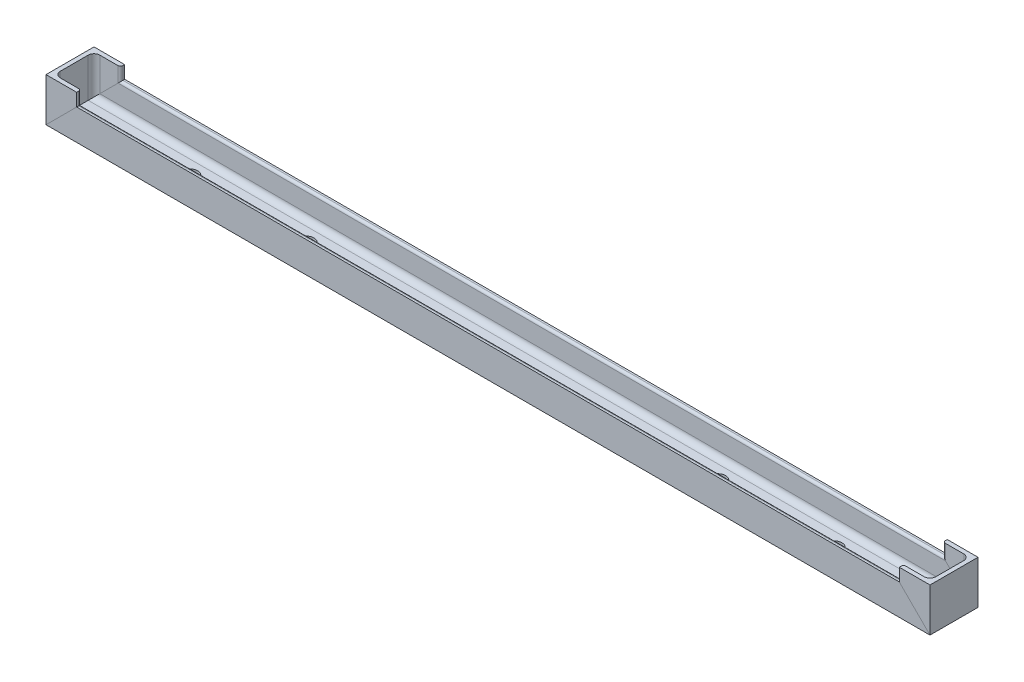
ISO-10303-21;
HEADER;
FILE_DESCRIPTION(('STEP AP214'),'2;1');
FILE_NAME('part.step','',(''),(''),'','','');
FILE_SCHEMA(('AUTOMOTIVE_DESIGN { 1 0 10303 214 1 1 1 1 }'));
ENDSEC;
DATA;
#1=APPLICATION_CONTEXT('core data for automotive mechanical design processes');
#2=APPLICATION_PROTOCOL_DEFINITION('international standard','automotive_design',2000,#1);
#3=PRODUCT_CONTEXT('',#1,'mechanical');
#4=PRODUCT('Part','Part','',(#3));
#5=PRODUCT_RELATED_PRODUCT_CATEGORY('part','',(#4));
#6=PRODUCT_DEFINITION_FORMATION('','',#4);
#7=PRODUCT_DEFINITION_CONTEXT('part definition',#1,'design');
#8=PRODUCT_DEFINITION('design','',#6,#7);
#9=PRODUCT_DEFINITION_SHAPE('','',#8);
#10=(LENGTH_UNIT() NAMED_UNIT(*) SI_UNIT(.MILLI.,.METRE.));
#11=(NAMED_UNIT(*) PLANE_ANGLE_UNIT() SI_UNIT($,.RADIAN.));
#12=(NAMED_UNIT(*) SI_UNIT($,.STERADIAN.) SOLID_ANGLE_UNIT());
#13=UNCERTAINTY_MEASURE_WITH_UNIT(LENGTH_MEASURE(1.E-05),#10,'distance_accuracy_value','');
#14=(GEOMETRIC_REPRESENTATION_CONTEXT(3) GLOBAL_UNCERTAINTY_ASSIGNED_CONTEXT((#13)) GLOBAL_UNIT_ASSIGNED_CONTEXT((#10,
#11,#12)) REPRESENTATION_CONTEXT('',''));
#15=CARTESIAN_POINT('',(0.,0.,0.));
#16=DIRECTION('',(0.,0.,1.));
#17=DIRECTION('',(1.,0.,0.));
#18=AXIS2_PLACEMENT_3D('',#15,#16,#17);
#19=CARTESIAN_POINT('',(-430.9,45.2499987337387,23.1));
#20=DIRECTION('',(0.,1.,0.));
#21=DIRECTION('',(0.,0.,1.));
#22=AXIS2_PLACEMENT_3D('',#19,#20,#21);
#23=PLANE('',#22);
#24=DIRECTION('',(-1.,0.,0.));
#25=VECTOR('',#24,1.);
#26=CARTESIAN_POINT('',(-460.4,45.2499987337387,25.));
#27=LINE('',#26,#25);
#28=CARTESIAN_POINT('',(-428.4,45.2499987337387,25.));
#29=VERTEX_POINT('',#28);
#30=CARTESIAN_POINT('',(-460.4,45.2499987337387,25.));
#31=VERTEX_POINT('',#30);
#32=EDGE_CURVE('E197',#29,#31,#27,.T.);
#33=ORIENTED_EDGE('',*,*,#32,.F.);
#34=DIRECTION('',(0.,0.,1.));
#35=VECTOR('',#34,1.);
#36=CARTESIAN_POINT('',(-428.4,45.2499987337387,25.));
#37=LINE('',#36,#35);
#38=CARTESIAN_POINT('',(-428.4,45.2499987337387,23.1));
#39=VERTEX_POINT('',#38);
#40=EDGE_CURVE('E200',#39,#29,#37,.T.);
#41=ORIENTED_EDGE('',*,*,#40,.F.);
#42=CARTESIAN_POINT('',(-430.9,45.2499987337387,23.1));
#43=DIRECTION('',(0.,-1.,0.));
#44=DIRECTION('',(0.,0.,1.));
#45=AXIS2_PLACEMENT_3D('',#42,#43,#44);
#46=CIRCLE('',#45,2.5);
#47=CARTESIAN_POINT('',(-430.9,45.2499987337387,20.6));
#48=VERTEX_POINT('',#47);
#49=EDGE_CURVE('E202',#48,#39,#46,.T.);
#50=ORIENTED_EDGE('',*,*,#49,.F.);
#51=DIRECTION('',(1.,0.,0.));
#52=VECTOR('',#51,1.);
#53=CARTESIAN_POINT('',(-430.9,45.2499987337387,20.6));
#54=LINE('',#53,#52);
#55=CARTESIAN_POINT('',(-450.,45.2499987337387,20.6));
#56=VERTEX_POINT('',#55);
#57=EDGE_CURVE('E204',#56,#48,#54,.T.);
#58=ORIENTED_EDGE('',*,*,#57,.F.);
#59=CARTESIAN_POINT('',(-450.,45.2499987337387,14.6));
#60=DIRECTION('',(0.,1.,0.));
#61=DIRECTION('',(0.,0.,-1.));
#62=AXIS2_PLACEMENT_3D('',#59,#60,#61);
#63=CIRCLE('',#62,6.);
#64=CARTESIAN_POINT('',(-456.,45.2499987337387,14.6));
#65=VERTEX_POINT('',#64);
#66=EDGE_CURVE('E206',#65,#56,#63,.T.);
#67=ORIENTED_EDGE('',*,*,#66,.F.);
#68=DIRECTION('',(0.,0.,1.));
#69=VECTOR('',#68,1.);
#70=CARTESIAN_POINT('',(-456.,45.2499987337387,14.6));
#71=LINE('',#70,#69);
#72=CARTESIAN_POINT('',(-456.,45.2499987337387,-14.6));
#73=VERTEX_POINT('',#72);
#74=EDGE_CURVE('E208',#73,#65,#71,.T.);
#75=ORIENTED_EDGE('',*,*,#74,.F.);
#76=CARTESIAN_POINT('',(-450.,45.2499987337387,-14.6));
#77=DIRECTION('',(0.,1.,0.));
#78=DIRECTION('',(0.,0.,1.));
#79=AXIS2_PLACEMENT_3D('',#76,#77,#78);
#80=CIRCLE('',#79,6.);
#81=CARTESIAN_POINT('',(-450.,45.2499987337387,-20.6));
#82=VERTEX_POINT('',#81);
#83=EDGE_CURVE('E210',#82,#73,#80,.T.);
#84=ORIENTED_EDGE('',*,*,#83,.F.);
#85=DIRECTION('',(-1.,0.,0.));
#86=VECTOR('',#85,1.);
#87=CARTESIAN_POINT('',(-430.9,45.2499987337387,-20.6));
#88=LINE('',#87,#86);
#89=CARTESIAN_POINT('',(-430.9,45.2499987337387,-20.6));
#90=VERTEX_POINT('',#89);
#91=EDGE_CURVE('E212',#90,#82,#88,.T.);
#92=ORIENTED_EDGE('',*,*,#91,.F.);
#93=CARTESIAN_POINT('',(-430.9,45.2499987337387,-23.1));
#94=DIRECTION('',(0.,-1.,0.));
#95=DIRECTION('',(0.,0.,-1.));
#96=AXIS2_PLACEMENT_3D('',#93,#94,#95);
#97=CIRCLE('',#96,2.5);
#98=CARTESIAN_POINT('',(-428.4,45.2499987337387,-23.1));
#99=VERTEX_POINT('',#98);
#100=EDGE_CURVE('E214',#99,#90,#97,.T.);
#101=ORIENTED_EDGE('',*,*,#100,.F.);
#102=DIRECTION('',(0.,0.,1.));
#103=VECTOR('',#102,1.);
#104=CARTESIAN_POINT('',(-428.4,45.2499987337387,-25.));
#105=LINE('',#104,#103);
#106=CARTESIAN_POINT('',(-428.4,45.2499987337387,-25.));
#107=VERTEX_POINT('',#106);
#108=EDGE_CURVE('E170',#107,#99,#105,.T.);
#109=ORIENTED_EDGE('',*,*,#108,.F.);
#110=DIRECTION('',(1.,0.,0.));
#111=VECTOR('',#110,1.);
#112=CARTESIAN_POINT('',(-460.4,45.2499987337387,-25.));
#113=LINE('',#112,#111);
#114=CARTESIAN_POINT('',(-460.4,45.2499987337387,-25.));
#115=VERTEX_POINT('',#114);
#116=EDGE_CURVE('E104',#115,#107,#113,.T.);
#117=ORIENTED_EDGE('',*,*,#116,.F.);
#118=DIRECTION('',(0.,0.,-1.));
#119=VECTOR('',#118,1.);
#120=CARTESIAN_POINT('',(-460.4,45.2499987337387,-25.));
#121=LINE('',#120,#119);
#122=EDGE_CURVE('E111',#31,#115,#121,.T.);
#123=ORIENTED_EDGE('',*,*,#122,.F.);
#124=EDGE_LOOP('',(#33,#41,#50,#58,#67,#75,#84,#92,#101,#109,#117,#123));
#125=FACE_BOUND('',#124,.T.);
#126=ADVANCED_FACE('F43',(#125),#23,.T.);
#127=CARTESIAN_POINT('',(-460.4,-0.199998781726211,-25.));
#128=DIRECTION('',(0.,0.,1.));
#129=DIRECTION('',(1.,0.,0.));
#130=AXIS2_PLACEMENT_3D('',#127,#128,#129);
#131=PLANE('',#130);
#132=DIRECTION('',(-0.707106781186547,-0.707106781186548,0.));
#133=VECTOR('',#132,1.);
#134=CARTESIAN_POINT('',(-230.200000609137,230.199999390863,-25.0000000000002));
#135=LINE('',#134,#133);
#136=CARTESIAN_POINT('',(-428.4,31.9999999999998,-25.));
#137=VERTEX_POINT('',#136);
#138=CARTESIAN_POINT('',(-460.400000609137,-1.23818000929594E-13,-25.));
#139=VERTEX_POINT('',#138);
#140=EDGE_CURVE('E163',#137,#139,#135,.T.);
#141=ORIENTED_EDGE('',*,*,#140,.T.);
#142=DIRECTION('',(0.,1.,0.));
#143=VECTOR('',#142,1.);
#144=CARTESIAN_POINT('',(-460.4,-0.199998781726211,-25.));
#145=LINE('',#144,#143);
#146=EDGE_CURVE('E243',#139,#115,#145,.T.);
#147=ORIENTED_EDGE('',*,*,#146,.T.);
#148=ORIENTED_EDGE('',*,*,#116,.T.);
#149=DIRECTION('',(0.,1.,0.));
#150=VECTOR('',#149,1.);
#151=CARTESIAN_POINT('',(-428.4,-0.199998781726211,-25.));
#152=LINE('',#151,#150);
#153=EDGE_CURVE('E173',#137,#107,#152,.T.);
#154=ORIENTED_EDGE('',*,*,#153,.F.);
#155=EDGE_LOOP('',(#141,#147,#148,#154));
#156=FACE_BOUND('',#155,.T.);
#157=ADVANCED_FACE('F512',(#156),#131,.F.);
#158=CARTESIAN_POINT('',(-428.4,-0.199998781726211,-25.));
#159=DIRECTION('',(-1.,0.,0.));
#160=DIRECTION('',(0.,0.,1.));
#161=AXIS2_PLACEMENT_3D('',#158,#159,#160);
#162=PLANE('',#161);
#163=DIRECTION('',(0.,0.,-1.));
#164=VECTOR('',#163,1.);
#165=CARTESIAN_POINT('',(-428.4,31.9999999999999,-25.));
#166=LINE('',#165,#164);
#167=CARTESIAN_POINT('',(-428.4,31.9999999999999,-23.1));
#168=VERTEX_POINT('',#167);
#169=EDGE_CURVE('E152',#168,#137,#166,.T.);
#170=ORIENTED_EDGE('',*,*,#169,.T.);
#171=ORIENTED_EDGE('',*,*,#153,.T.);
#172=ORIENTED_EDGE('',*,*,#108,.T.);
#173=DIRECTION('',(0.,1.,0.));
#174=VECTOR('',#173,1.);
#175=CARTESIAN_POINT('',(-428.4,-0.199998781726211,-23.1));
#176=LINE('',#175,#174);
#177=EDGE_CURVE('E167',#168,#99,#176,.T.);
#178=ORIENTED_EDGE('',*,*,#177,.F.);
#179=EDGE_LOOP('',(#170,#171,#172,#178));
#180=FACE_BOUND('',#179,.T.);
#181=ADVANCED_FACE('F169',(#180),#162,.F.);
#182=CARTESIAN_POINT('',(-430.9,-0.199998781726211,-23.1));
#183=DIRECTION('',(0.,1.,0.));
#184=DIRECTION('',(0.,0.,1.));
#185=AXIS2_PLACEMENT_3D('',#182,#183,#184);
#186=CYLINDRICAL_SURFACE('',#185,2.5);
#187=CARTESIAN_POINT('',(-430.9,29.4999999999999,-23.1));
#188=DIRECTION('',(-0.707106781186548,0.707106781186547,0.));
#189=DIRECTION('',(-0.707106781186547,-0.707106781186548,0.));
#190=AXIS2_PLACEMENT_3D('',#187,#188,#189);
#191=ELLIPSE('',#190,3.53553390593274,2.5);
#192=CARTESIAN_POINT('',(-430.9,29.4999999999999,-20.6));
#193=VERTEX_POINT('',#192);
#194=EDGE_CURVE('E164',#193,#168,#191,.T.);
#195=ORIENTED_EDGE('',*,*,#194,.T.);
#196=ORIENTED_EDGE('',*,*,#177,.T.);
#197=ORIENTED_EDGE('',*,*,#100,.T.);
#198=DIRECTION('',(0.,1.,0.));
#199=VECTOR('',#198,1.);
#200=CARTESIAN_POINT('',(-430.9,-0.199998781726211,-20.6));
#201=LINE('',#200,#199);
#202=EDGE_CURVE('E174',#193,#90,#201,.T.);
#203=ORIENTED_EDGE('',*,*,#202,.F.);
#204=EDGE_LOOP('',(#195,#196,#197,#203));
#205=FACE_BOUND('',#204,.T.);
#206=ADVANCED_FACE('F177',(#205),#186,.T.);
#207=CARTESIAN_POINT('',(-430.9,-0.199998781726211,-20.6));
#208=DIRECTION('',(0.,0.,-1.));
#209=DIRECTION('',(-1.,0.,0.));
#210=AXIS2_PLACEMENT_3D('',#207,#208,#209);
#211=PLANE('',#210);
#212=DIRECTION('',(0.707106781186547,0.707106781186548,0.));
#213=VECTOR('',#212,1.);
#214=CARTESIAN_POINT('',(-215.450000609137,244.949999390863,-20.6000000000003));
#215=LINE('',#214,#213);
#216=CARTESIAN_POINT('',(-450.,10.3999999999999,-20.6));
#217=VERTEX_POINT('',#216);
#218=EDGE_CURVE('E182',#217,#193,#215,.T.);
#219=ORIENTED_EDGE('',*,*,#218,.T.);
#220=ORIENTED_EDGE('',*,*,#202,.T.);
#221=ORIENTED_EDGE('',*,*,#91,.T.);
#222=DIRECTION('',(0.,1.,0.));
#223=VECTOR('',#222,1.);
#224=CARTESIAN_POINT('',(-450.,-0.199998781726211,-20.6));
#225=LINE('',#224,#223);
#226=EDGE_CURVE('E238',#217,#82,#225,.T.);
#227=ORIENTED_EDGE('',*,*,#226,.F.);
#228=EDGE_LOOP('',(#219,#220,#221,#227));
#229=FACE_BOUND('',#228,.T.);
#230=ADVANCED_FACE('F829',(#229),#211,.F.);
#231=CARTESIAN_POINT('',(-450.,-0.199998781726211,-14.6));
#232=DIRECTION('',(0.,1.,0.));
#233=DIRECTION('',(0.,0.,1.));
#234=AXIS2_PLACEMENT_3D('',#231,#232,#233);
#235=CYLINDRICAL_SURFACE('',#234,6.);
#236=CARTESIAN_POINT('',(-450.,10.3999999999999,-14.6));
#237=DIRECTION('',(-0.707106781186548,0.707106781186547,0.));
#238=DIRECTION('',(-0.707106781186547,-0.707106781186548,0.));
#239=AXIS2_PLACEMENT_3D('',#236,#237,#238);
#240=ELLIPSE('',#239,8.48528137423857,6.);
#241=CARTESIAN_POINT('',(-456.,4.3999999999999,-14.6));
#242=VERTEX_POINT('',#241);
#243=EDGE_CURVE('E393',#242,#217,#240,.F.);
#244=ORIENTED_EDGE('',*,*,#243,.T.);
#245=ORIENTED_EDGE('',*,*,#226,.T.);
#246=ORIENTED_EDGE('',*,*,#83,.T.);
#247=DIRECTION('',(0.,1.,0.));
#248=VECTOR('',#247,1.);
#249=CARTESIAN_POINT('',(-456.,-0.199998781726211,-14.6));
#250=LINE('',#249,#248);
#251=EDGE_CURVE('E235',#242,#73,#250,.T.);
#252=ORIENTED_EDGE('',*,*,#251,.F.);
#253=EDGE_LOOP('',(#244,#245,#246,#252));
#254=FACE_BOUND('',#253,.T.);
#255=ADVANCED_FACE('F837',(#254),#235,.F.);
#256=CARTESIAN_POINT('',(-456.,-0.199998781726211,14.6));
#257=DIRECTION('',(-1.,0.,0.));
#258=DIRECTION('',(0.,0.,1.));
#259=AXIS2_PLACEMENT_3D('',#256,#257,#258);
#260=PLANE('',#259);
#261=DIRECTION('',(0.,0.,-1.));
#262=VECTOR('',#261,1.);
#263=CARTESIAN_POINT('',(-456.,4.3999999999999,14.6));
#264=LINE('',#263,#262);
#265=CARTESIAN_POINT('',(-456.,4.3999999999999,14.6));
#266=VERTEX_POINT('',#265);
#267=EDGE_CURVE('E390',#266,#242,#264,.T.);
#268=ORIENTED_EDGE('',*,*,#267,.T.);
#269=ORIENTED_EDGE('',*,*,#251,.T.);
#270=ORIENTED_EDGE('',*,*,#74,.T.);
#271=DIRECTION('',(0.,1.,0.));
#272=VECTOR('',#271,1.);
#273=CARTESIAN_POINT('',(-456.,-0.199998781726211,14.6));
#274=LINE('',#273,#272);
#275=EDGE_CURVE('E232',#266,#65,#274,.T.);
#276=ORIENTED_EDGE('',*,*,#275,.F.);
#277=EDGE_LOOP('',(#268,#269,#270,#276));
#278=FACE_BOUND('',#277,.T.);
#279=ADVANCED_FACE('F846',(#278),#260,.F.);
#280=CARTESIAN_POINT('',(-450.,-0.199998781726211,14.6));
#281=DIRECTION('',(0.,1.,0.));
#282=DIRECTION('',(0.,0.,1.));
#283=AXIS2_PLACEMENT_3D('',#280,#281,#282);
#284=CYLINDRICAL_SURFACE('',#283,6.);
#285=CARTESIAN_POINT('',(-450.,10.3999999999999,14.6));
#286=DIRECTION('',(-0.707106781186548,0.707106781186547,0.));
#287=DIRECTION('',(-0.707106781186547,-0.707106781186548,0.));
#288=AXIS2_PLACEMENT_3D('',#285,#286,#287);
#289=ELLIPSE('',#288,8.48528137423857,6.);
#290=CARTESIAN_POINT('',(-450.,10.4,20.6));
#291=VERTEX_POINT('',#290);
#292=EDGE_CURVE('E387',#291,#266,#289,.F.);
#293=ORIENTED_EDGE('',*,*,#292,.T.);
#294=ORIENTED_EDGE('',*,*,#275,.T.);
#295=ORIENTED_EDGE('',*,*,#66,.T.);
#296=DIRECTION('',(0.,1.,0.));
#297=VECTOR('',#296,1.);
#298=CARTESIAN_POINT('',(-450.,-0.199998781726211,20.6));
#299=LINE('',#298,#297);
#300=EDGE_CURVE('E229',#291,#56,#299,.T.);
#301=ORIENTED_EDGE('',*,*,#300,.F.);
#302=EDGE_LOOP('',(#293,#294,#295,#301));
#303=FACE_BOUND('',#302,.T.);
#304=ADVANCED_FACE('F855',(#303),#284,.F.);
#305=CARTESIAN_POINT('',(-430.9,-0.199998781726211,20.6));
#306=DIRECTION('',(0.,0.,1.));
#307=DIRECTION('',(1.,0.,0.));
#308=AXIS2_PLACEMENT_3D('',#305,#306,#307);
#309=PLANE('',#308);
#310=DIRECTION('',(-0.707106781186547,-0.707106781186548,0.));
#311=VECTOR('',#310,1.);
#312=CARTESIAN_POINT('',(-215.450000609137,244.949999390863,20.5999999999998));
#313=LINE('',#312,#311);
#314=CARTESIAN_POINT('',(-430.9,29.4999999999999,20.6));
#315=VERTEX_POINT('',#314);
#316=EDGE_CURVE('E384',#315,#291,#313,.T.);
#317=ORIENTED_EDGE('',*,*,#316,.T.);
#318=ORIENTED_EDGE('',*,*,#300,.T.);
#319=ORIENTED_EDGE('',*,*,#57,.T.);
#320=DIRECTION('',(0.,1.,0.));
#321=VECTOR('',#320,1.);
#322=CARTESIAN_POINT('',(-430.9,-0.199998781726211,20.6));
#323=LINE('',#322,#321);
#324=EDGE_CURVE('E226',#315,#48,#323,.T.);
#325=ORIENTED_EDGE('',*,*,#324,.F.);
#326=EDGE_LOOP('',(#317,#318,#319,#325));
#327=FACE_BOUND('',#326,.T.);
#328=ADVANCED_FACE('F864',(#327),#309,.F.);
#329=CARTESIAN_POINT('',(-430.9,-0.199998781726211,23.1));
#330=DIRECTION('',(0.,1.,0.));
#331=DIRECTION('',(0.,0.,1.));
#332=AXIS2_PLACEMENT_3D('',#329,#330,#331);
#333=CYLINDRICAL_SURFACE('',#332,2.5);
#334=CARTESIAN_POINT('',(-430.9,29.4999999999999,23.1));
#335=DIRECTION('',(-0.707106781186548,0.707106781186547,0.));
#336=DIRECTION('',(-0.707106781186547,-0.707106781186548,0.));
#337=AXIS2_PLACEMENT_3D('',#334,#335,#336);
#338=ELLIPSE('',#337,3.53553390593274,2.5);
#339=CARTESIAN_POINT('',(-428.4,31.9999999999999,23.1));
#340=VERTEX_POINT('',#339);
#341=EDGE_CURVE('E381',#340,#315,#338,.T.);
#342=ORIENTED_EDGE('',*,*,#341,.T.);
#343=ORIENTED_EDGE('',*,*,#324,.T.);
#344=ORIENTED_EDGE('',*,*,#49,.T.);
#345=DIRECTION('',(0.,1.,0.));
#346=VECTOR('',#345,1.);
#347=CARTESIAN_POINT('',(-428.4,-0.199998781726211,23.1));
#348=LINE('',#347,#346);
#349=EDGE_CURVE('E223',#340,#39,#348,.T.);
#350=ORIENTED_EDGE('',*,*,#349,.F.);
#351=EDGE_LOOP('',(#342,#343,#344,#350));
#352=FACE_BOUND('',#351,.T.);
#353=ADVANCED_FACE('F873',(#352),#333,.T.);
#354=CARTESIAN_POINT('',(-428.4,-0.199998781726211,25.));
#355=DIRECTION('',(-1.,0.,0.));
#356=DIRECTION('',(0.,0.,1.));
#357=AXIS2_PLACEMENT_3D('',#354,#355,#356);
#358=PLANE('',#357);
#359=DIRECTION('',(0.,0.,-1.));
#360=VECTOR('',#359,1.);
#361=CARTESIAN_POINT('',(-428.4,31.9999999999999,25.));
#362=LINE('',#361,#360);
#363=CARTESIAN_POINT('',(-428.4,31.9999999999999,25.));
#364=VERTEX_POINT('',#363);
#365=EDGE_CURVE('E378',#364,#340,#362,.T.);
#366=ORIENTED_EDGE('',*,*,#365,.T.);
#367=ORIENTED_EDGE('',*,*,#349,.T.);
#368=ORIENTED_EDGE('',*,*,#40,.T.);
#369=DIRECTION('',(0.,1.,0.));
#370=VECTOR('',#369,1.);
#371=CARTESIAN_POINT('',(-428.4,-0.199998781726211,25.));
#372=LINE('',#371,#370);
#373=EDGE_CURVE('E220',#364,#29,#372,.T.);
#374=ORIENTED_EDGE('',*,*,#373,.F.);
#375=EDGE_LOOP('',(#366,#367,#368,#374));
#376=FACE_BOUND('',#375,.T.);
#377=ADVANCED_FACE('F882',(#376),#358,.F.);
#378=CARTESIAN_POINT('',(-460.4,-0.199998781726211,25.));
#379=DIRECTION('',(0.,0.,-1.));
#380=DIRECTION('',(-1.,0.,0.));
#381=AXIS2_PLACEMENT_3D('',#378,#379,#380);
#382=PLANE('',#381);
#383=DIRECTION('',(0.707106781186547,0.707106781186548,0.));
#384=VECTOR('',#383,1.);
#385=CARTESIAN_POINT('',(-230.200000609137,230.199999390863,24.9999999999998));
#386=LINE('',#385,#384);
#387=CARTESIAN_POINT('',(-460.400000609137,0.,25.));
#388=VERTEX_POINT('',#387);
#389=EDGE_CURVE('E119',#388,#364,#386,.T.);
#390=ORIENTED_EDGE('',*,*,#389,.T.);
#391=ORIENTED_EDGE('',*,*,#373,.T.);
#392=ORIENTED_EDGE('',*,*,#32,.T.);
#393=DIRECTION('',(0.,1.,0.));
#394=VECTOR('',#393,1.);
#395=CARTESIAN_POINT('',(-460.4,-0.199998781726211,25.));
#396=LINE('',#395,#394);
#397=EDGE_CURVE('E218',#388,#31,#396,.T.);
#398=ORIENTED_EDGE('',*,*,#397,.F.);
#399=EDGE_LOOP('',(#390,#391,#392,#398));
#400=FACE_BOUND('',#399,.T.);
#401=ADVANCED_FACE('F891',(#400),#382,.F.);
#402=CARTESIAN_POINT('',(-460.4,-0.199998781726211,-25.));
#403=DIRECTION('',(1.,0.,0.));
#404=DIRECTION('',(0.,0.,-1.));
#405=AXIS2_PLACEMENT_3D('',#402,#403,#404);
#406=PLANE('',#405);
#407=DIRECTION('',(0.,0.,-1.));
#408=VECTOR('',#407,1.);
#409=CARTESIAN_POINT('',(-460.400001218274,-1.11022302462516E-13,-25.));
#410=LINE('',#409,#408);
#411=EDGE_CURVE('E61',#388,#139,#410,.T.);
#412=ORIENTED_EDGE('',*,*,#411,.F.);
#413=ORIENTED_EDGE('',*,*,#397,.T.);
#414=ORIENTED_EDGE('',*,*,#122,.T.);
#415=ORIENTED_EDGE('',*,*,#146,.F.);
#416=EDGE_LOOP('',(#412,#413,#414,#415));
#417=FACE_BOUND('',#416,.T.);
#418=ADVANCED_FACE('F561',(#417),#406,.F.);
#419=CARTESIAN_POINT('',(-1.21827387067341E-06,0.,-25.));
#420=DIRECTION('',(0.,1.,0.));
#421=DIRECTION('',(0.,0.,1.));
#422=AXIS2_PLACEMENT_3D('',#419,#420,#421);
#423=PLANE('',#422);
#424=CARTESIAN_POINT('',(-335.600004523273,0.,-0.0208885483481435));
#425=DIRECTION('',(0.,1.,0.));
#426=DIRECTION('',(0.,0.,1.));
#427=AXIS2_PLACEMENT_3D('',#424,#425,#426);
#428=CIRCLE('',#427,8.08);
#429=CARTESIAN_POINT('',(-335.600004523273,0.,8.05911145165186));
#430=VERTEX_POINT('',#429);
#431=EDGE_CURVE('E198',#430,#430,#428,.F.);
#432=ORIENTED_EDGE('',*,*,#431,.F.);
#433=EDGE_LOOP('',(#432));
#434=FACE_BOUND('',#433,.T.);
#435=CARTESIAN_POINT('',(-214.400004523273,0.,-0.0208885483481435));
#436=DIRECTION('',(0.,1.,0.));
#437=DIRECTION('',(0.,0.,1.));
#438=AXIS2_PLACEMENT_3D('',#435,#436,#437);
#439=CIRCLE('',#438,8.08);
#440=CARTESIAN_POINT('',(-214.400004523273,0.,8.05911145165186));
#441=VERTEX_POINT('',#440);
#442=EDGE_CURVE('E246',#441,#441,#439,.F.);
#443=ORIENTED_EDGE('',*,*,#442,.F.);
#444=EDGE_LOOP('',(#443));
#445=FACE_BOUND('',#444,.T.);
#446=ORIENTED_EDGE('',*,*,#411,.T.);
#447=DIRECTION('',(-1.,0.,0.));
#448=VECTOR('',#447,1.);
#449=CARTESIAN_POINT('',(-1.21827387067341E-06,0.,-25.));
#450=LINE('',#449,#448);
#451=CARTESIAN_POINT('',(460.400000609137,0.,-25.));
#452=VERTEX_POINT('',#451);
#453=EDGE_CURVE('E13',#452,#139,#450,.T.);
#454=ORIENTED_EDGE('',*,*,#453,.F.);
#455=DIRECTION('',(0.,0.,-1.));
#456=VECTOR('',#455,1.);
#457=CARTESIAN_POINT('',(460.400001218274,0.,-25.));
#458=LINE('',#457,#456);
#459=CARTESIAN_POINT('',(460.400000609137,0.,25.));
#460=VERTEX_POINT('',#459);
#461=EDGE_CURVE('E247',#460,#452,#458,.T.);
#462=ORIENTED_EDGE('',*,*,#461,.F.);
#463=DIRECTION('',(-1.,0.,0.));
#464=VECTOR('',#463,1.);
#465=CARTESIAN_POINT('',(-1.21827387067341E-06,0.,25.));
#466=LINE('',#465,#464);
#467=EDGE_CURVE('E374',#460,#388,#466,.T.);
#468=ORIENTED_EDGE('',*,*,#467,.T.);
#469=EDGE_LOOP('',(#446,#454,#462,#468));
#470=FACE_BOUND('',#469,.T.);
#471=CARTESIAN_POINT('',(335.600004523273,0.,-0.0208885483481435));
#472=DIRECTION('',(0.,-1.,0.));
#473=DIRECTION('',(0.,0.,1.));
#474=AXIS2_PLACEMENT_3D('',#471,#472,#473);
#475=CIRCLE('',#474,8.08);
#476=CARTESIAN_POINT('',(335.600004523273,0.,8.05911145165186));
#477=VERTEX_POINT('',#476);
#478=EDGE_CURVE('E265',#477,#477,#475,.F.);
#479=ORIENTED_EDGE('',*,*,#478,.T.);
#480=EDGE_LOOP('',(#479));
#481=FACE_BOUND('',#480,.T.);
#482=CARTESIAN_POINT('',(214.400004523273,0.,-0.0208885483481435));
#483=DIRECTION('',(0.,-1.,0.));
#484=DIRECTION('',(0.,0.,1.));
#485=AXIS2_PLACEMENT_3D('',#482,#483,#484);
#486=CIRCLE('',#485,8.08);
#487=CARTESIAN_POINT('',(214.400004523273,0.,8.05911145165186));
#488=VERTEX_POINT('',#487);
#489=EDGE_CURVE('E367',#488,#488,#486,.F.);
#490=ORIENTED_EDGE('',*,*,#489,.T.);
#491=EDGE_LOOP('',(#490));
#492=FACE_BOUND('',#491,.T.);
#493=ADVANCED_FACE('F558',(#434,#445,#470,#481,#492),#423,.F.);
#494=CARTESIAN_POINT('',(-1.21827387067341E-06,0.,-25.));
#495=DIRECTION('',(0.,0.,1.));
#496=DIRECTION('',(0.,-1.,0.));
#497=AXIS2_PLACEMENT_3D('',#494,#495,#496);
#498=PLANE('',#497);
#499=DIRECTION('',(-1.,0.,0.));
#500=VECTOR('',#499,1.);
#501=CARTESIAN_POINT('',(-1.21827387761231E-06,31.9999999999999,-25.));
#502=LINE('',#501,#500);
#503=CARTESIAN_POINT('',(428.4,32.,-25.));
#504=VERTEX_POINT('',#503);
#505=EDGE_CURVE('E52',#504,#137,#502,.T.);
#506=ORIENTED_EDGE('',*,*,#505,.F.);
#507=DIRECTION('',(0.707106781186548,-0.707106781186547,0.));
#508=VECTOR('',#507,1.);
#509=CARTESIAN_POINT('',(230.200000609137,230.199999390863,-25.0000000000002));
#510=LINE('',#509,#508);
#511=EDGE_CURVE('E253',#504,#452,#510,.T.);
#512=ORIENTED_EDGE('',*,*,#511,.T.);
#513=ORIENTED_EDGE('',*,*,#453,.T.);
#514=ORIENTED_EDGE('',*,*,#140,.F.);
#515=EDGE_LOOP('',(#506,#512,#513,#514));
#516=FACE_BOUND('',#515,.T.);
#517=ADVANCED_FACE('F511',(#516),#498,.F.);
#518=CARTESIAN_POINT('',(-1.21827387761231E-06,31.9999999999999,-25.));
#519=DIRECTION('',(0.,-1.,0.));
#520=DIRECTION('',(1.,0.,0.));
#521=AXIS2_PLACEMENT_3D('',#518,#519,#520);
#522=PLANE('',#521);
#523=DIRECTION('',(-1.,0.,0.));
#524=VECTOR('',#523,1.);
#525=CARTESIAN_POINT('',(-1.21827387761231E-06,31.9999999999999,-23.1));
#526=LINE('',#525,#524);
#527=CARTESIAN_POINT('',(428.4,32.,-23.1));
#528=VERTEX_POINT('',#527);
#529=EDGE_CURVE('E158',#528,#168,#526,.T.);
#530=ORIENTED_EDGE('',*,*,#529,.F.);
#531=DIRECTION('',(0.,0.,-1.));
#532=VECTOR('',#531,1.);
#533=CARTESIAN_POINT('',(428.4,32.,-25.));
#534=LINE('',#533,#532);
#535=EDGE_CURVE('E261',#528,#504,#534,.T.);
#536=ORIENTED_EDGE('',*,*,#535,.T.);
#537=ORIENTED_EDGE('',*,*,#505,.T.);
#538=ORIENTED_EDGE('',*,*,#169,.F.);
#539=EDGE_LOOP('',(#530,#536,#537,#538));
#540=FACE_BOUND('',#539,.T.);
#541=ADVANCED_FACE('F154',(#540),#522,.F.);
#542=CARTESIAN_POINT('',(-1.21827387761231E-06,29.4999999999999,-23.1));
#543=DIRECTION('',(-1.,0.,0.));
#544=DIRECTION('',(0.,-1.,0.));
#545=AXIS2_PLACEMENT_3D('',#542,#543,#544);
#546=CYLINDRICAL_SURFACE('',#545,2.5);
#547=DIRECTION('',(-1.,0.,0.));
#548=VECTOR('',#547,1.);
#549=CARTESIAN_POINT('',(-1.21827387761231E-06,29.4999999999999,-20.6));
#550=LINE('',#549,#548);
#551=CARTESIAN_POINT('',(430.9,29.5,-20.6));
#552=VERTEX_POINT('',#551);
#553=EDGE_CURVE('E188',#552,#193,#550,.T.);
#554=ORIENTED_EDGE('',*,*,#553,.F.);
#555=CARTESIAN_POINT('',(430.9,29.5,-23.1));
#556=DIRECTION('',(-0.707106781186547,-0.707106781186548,0.));
#557=DIRECTION('',(0.707106781186548,-0.707106781186547,0.));
#558=AXIS2_PLACEMENT_3D('',#555,#556,#557);
#559=ELLIPSE('',#558,3.53553390593274,2.5);
#560=EDGE_CURVE('E186',#552,#528,#559,.T.);
#561=ORIENTED_EDGE('',*,*,#560,.T.);
#562=ORIENTED_EDGE('',*,*,#529,.T.);
#563=ORIENTED_EDGE('',*,*,#194,.F.);
#564=EDGE_LOOP('',(#554,#561,#562,#563));
#565=FACE_BOUND('',#564,.T.);
#566=ADVANCED_FACE('F184',(#565),#546,.T.);
#567=CARTESIAN_POINT('',(-1.21827387761231E-06,29.4999999999999,-20.6));
#568=DIRECTION('',(0.,0.,-1.));
#569=DIRECTION('',(0.,1.,0.));
#570=AXIS2_PLACEMENT_3D('',#567,#568,#569);
#571=PLANE('',#570);
#572=DIRECTION('',(-1.,0.,0.));
#573=VECTOR('',#572,1.);
#574=CARTESIAN_POINT('',(-1.21827387761231E-06,10.4,-20.6));
#575=LINE('',#574,#573);
#576=CARTESIAN_POINT('',(450.,10.4,-20.6));
#577=VERTEX_POINT('',#576);
#578=EDGE_CURVE('E192',#577,#217,#575,.T.);
#579=ORIENTED_EDGE('',*,*,#578,.F.);
#580=DIRECTION('',(-0.707106781186548,0.707106781186547,0.));
#581=VECTOR('',#580,1.);
#582=CARTESIAN_POINT('',(215.450000609137,244.949999390863,-20.6000000000003));
#583=LINE('',#582,#581);
#584=EDGE_CURVE('E289',#577,#552,#583,.T.);
#585=ORIENTED_EDGE('',*,*,#584,.T.);
#586=ORIENTED_EDGE('',*,*,#553,.T.);
#587=ORIENTED_EDGE('',*,*,#218,.F.);
#588=EDGE_LOOP('',(#579,#585,#586,#587));
#589=FACE_BOUND('',#588,.T.);
#590=ADVANCED_FACE('F424',(#589),#571,.F.);
#591=CARTESIAN_POINT('',(-1.21827387761231E-06,10.4,-14.6));
#592=DIRECTION('',(-1.,0.,0.));
#593=DIRECTION('',(0.,-1.,0.));
#594=AXIS2_PLACEMENT_3D('',#591,#592,#593);
#595=CYLINDRICAL_SURFACE('',#594,6.);
#596=DIRECTION('',(-1.,0.,0.));
#597=VECTOR('',#596,1.);
#598=CARTESIAN_POINT('',(-1.21827387067341E-06,4.39999999999996,-14.6));
#599=LINE('',#598,#597);
#600=CARTESIAN_POINT('',(456.,4.40000000000005,-14.6));
#601=VERTEX_POINT('',#600);
#602=EDGE_CURVE('E412',#601,#242,#599,.T.);
#603=ORIENTED_EDGE('',*,*,#602,.F.);
#604=CARTESIAN_POINT('',(450.,10.4000000000001,-14.6));
#605=DIRECTION('',(-0.707106781186547,-0.707106781186548,0.));
#606=DIRECTION('',(0.707106781186548,-0.707106781186547,0.));
#607=AXIS2_PLACEMENT_3D('',#604,#605,#606);
#608=ELLIPSE('',#607,8.48528137423857,6.);
#609=EDGE_CURVE('E286',#601,#577,#608,.F.);
#610=ORIENTED_EDGE('',*,*,#609,.T.);
#611=ORIENTED_EDGE('',*,*,#578,.T.);
#612=ORIENTED_EDGE('',*,*,#243,.F.);
#613=EDGE_LOOP('',(#603,#610,#611,#612));
#614=FACE_BOUND('',#613,.T.);
#615=ADVANCED_FACE('F418',(#614),#595,.F.);
#616=CARTESIAN_POINT('',(-1.21827387067341E-06,4.39999999999996,14.6));
#617=DIRECTION('',(0.,-1.,0.));
#618=DIRECTION('',(1.,0.,0.));
#619=AXIS2_PLACEMENT_3D('',#616,#617,#618);
#620=PLANE('',#619);
#621=CARTESIAN_POINT('',(-335.600004523273,4.39999999999993,-0.0208885483481435));
#622=DIRECTION('',(0.,-1.,0.));
#623=DIRECTION('',(1.,0.,0.));
#624=AXIS2_PLACEMENT_3D('',#621,#622,#623);
#625=CIRCLE('',#624,8.08);
#626=CARTESIAN_POINT('',(-327.520004523273,4.39999999999993,-0.0208885483481435));
#627=VERTEX_POINT('',#626);
#628=EDGE_CURVE('E46',#627,#627,#625,.F.);
#629=ORIENTED_EDGE('',*,*,#628,.F.);
#630=EDGE_LOOP('',(#629));
#631=FACE_BOUND('',#630,.T.);
#632=CARTESIAN_POINT('',(-214.400004523273,4.39999999999993,-0.0208885483481435));
#633=DIRECTION('',(0.,-1.,0.));
#634=DIRECTION('',(1.,0.,0.));
#635=AXIS2_PLACEMENT_3D('',#632,#633,#634);
#636=CIRCLE('',#635,8.08);
#637=CARTESIAN_POINT('',(-206.320004523273,4.39999999999993,-0.0208885483481435));
#638=VERTEX_POINT('',#637);
#639=EDGE_CURVE('E244',#638,#638,#636,.F.);
#640=ORIENTED_EDGE('',*,*,#639,.F.);
#641=EDGE_LOOP('',(#640));
#642=FACE_BOUND('',#641,.T.);
#643=DIRECTION('',(-1.,0.,0.));
#644=VECTOR('',#643,1.);
#645=CARTESIAN_POINT('',(-1.21827387067341E-06,4.39999999999996,14.6));
#646=LINE('',#645,#644);
#647=CARTESIAN_POINT('',(456.,4.40000000000005,14.6));
#648=VERTEX_POINT('',#647);
#649=EDGE_CURVE('E409',#648,#266,#646,.T.);
#650=ORIENTED_EDGE('',*,*,#649,.F.);
#651=DIRECTION('',(0.,0.,-1.));
#652=VECTOR('',#651,1.);
#653=CARTESIAN_POINT('',(456.,4.40000000000005,14.6));
#654=LINE('',#653,#652);
#655=EDGE_CURVE('E283',#648,#601,#654,.T.);
#656=ORIENTED_EDGE('',*,*,#655,.T.);
#657=ORIENTED_EDGE('',*,*,#602,.T.);
#658=ORIENTED_EDGE('',*,*,#267,.F.);
#659=EDGE_LOOP('',(#650,#656,#657,#658));
#660=FACE_BOUND('',#659,.T.);
#661=CARTESIAN_POINT('',(335.600004523273,4.40000000000004,-0.0208885483481435));
#662=DIRECTION('',(0.,1.,0.));
#663=DIRECTION('',(-1.,0.,0.));
#664=AXIS2_PLACEMENT_3D('',#661,#662,#663);
#665=CIRCLE('',#664,8.08);
#666=CARTESIAN_POINT('',(327.520004523273,4.40000000000004,-0.0208885483481435));
#667=VERTEX_POINT('',#666);
#668=EDGE_CURVE('E368',#667,#667,#665,.F.);
#669=ORIENTED_EDGE('',*,*,#668,.T.);
#670=EDGE_LOOP('',(#669));
#671=FACE_BOUND('',#670,.T.);
#672=CARTESIAN_POINT('',(214.400004523273,4.4,-0.0208885483481435));
#673=DIRECTION('',(0.,1.,0.));
#674=DIRECTION('',(-1.,0.,0.));
#675=AXIS2_PLACEMENT_3D('',#672,#673,#674);
#676=CIRCLE('',#675,8.08);
#677=CARTESIAN_POINT('',(206.320004523273,4.4,-0.0208885483481435));
#678=VERTEX_POINT('',#677);
#679=EDGE_CURVE('E364',#678,#678,#676,.F.);
#680=ORIENTED_EDGE('',*,*,#679,.T.);
#681=EDGE_LOOP('',(#680));
#682=FACE_BOUND('',#681,.T.);
#683=ADVANCED_FACE('F482',(#631,#642,#660,#671,#682),#620,.F.);
#684=CARTESIAN_POINT('',(-1.21827387761231E-06,10.4,14.6));
#685=DIRECTION('',(-1.,0.,0.));
#686=DIRECTION('',(0.,-1.,0.));
#687=AXIS2_PLACEMENT_3D('',#684,#685,#686);
#688=CYLINDRICAL_SURFACE('',#687,6.);
#689=DIRECTION('',(-1.,0.,0.));
#690=VECTOR('',#689,1.);
#691=CARTESIAN_POINT('',(-1.21827387761231E-06,10.4,20.6));
#692=LINE('',#691,#690);
#693=CARTESIAN_POINT('',(450.,10.4000000000001,20.6));
#694=VERTEX_POINT('',#693);
#695=EDGE_CURVE('E406',#694,#291,#692,.T.);
#696=ORIENTED_EDGE('',*,*,#695,.F.);
#697=CARTESIAN_POINT('',(450.,10.4000000000001,14.6));
#698=DIRECTION('',(-0.707106781186547,-0.707106781186548,0.));
#699=DIRECTION('',(0.707106781186548,-0.707106781186547,0.));
#700=AXIS2_PLACEMENT_3D('',#697,#698,#699);
#701=ELLIPSE('',#700,8.48528137423857,6.);
#702=EDGE_CURVE('E280',#694,#648,#701,.F.);
#703=ORIENTED_EDGE('',*,*,#702,.T.);
#704=ORIENTED_EDGE('',*,*,#649,.T.);
#705=ORIENTED_EDGE('',*,*,#292,.F.);
#706=EDGE_LOOP('',(#696,#703,#704,#705));
#707=FACE_BOUND('',#706,.T.);
#708=ADVANCED_FACE('F490',(#707),#688,.F.);
#709=CARTESIAN_POINT('',(-1.21827387761231E-06,29.5,20.6));
#710=DIRECTION('',(0.,0.,1.));
#711=DIRECTION('',(0.,-1.,0.));
#712=AXIS2_PLACEMENT_3D('',#709,#710,#711);
#713=PLANE('',#712);
#714=DIRECTION('',(-1.,0.,0.));
#715=VECTOR('',#714,1.);
#716=CARTESIAN_POINT('',(-1.21827387761231E-06,29.5,20.6));
#717=LINE('',#716,#715);
#718=CARTESIAN_POINT('',(430.9,29.5,20.6));
#719=VERTEX_POINT('',#718);
#720=EDGE_CURVE('E403',#719,#315,#717,.T.);
#721=ORIENTED_EDGE('',*,*,#720,.F.);
#722=DIRECTION('',(0.707106781186548,-0.707106781186547,0.));
#723=VECTOR('',#722,1.);
#724=CARTESIAN_POINT('',(215.450000609137,244.949999390863,20.5999999999998));
#725=LINE('',#724,#723);
#726=EDGE_CURVE('E277',#719,#694,#725,.T.);
#727=ORIENTED_EDGE('',*,*,#726,.T.);
#728=ORIENTED_EDGE('',*,*,#695,.T.);
#729=ORIENTED_EDGE('',*,*,#316,.F.);
#730=EDGE_LOOP('',(#721,#727,#728,#729));
#731=FACE_BOUND('',#730,.T.);
#732=ADVANCED_FACE('F538',(#731),#713,.F.);
#733=CARTESIAN_POINT('',(-1.21827387761231E-06,29.5,23.1));
#734=DIRECTION('',(-1.,0.,0.));
#735=DIRECTION('',(0.,-1.,0.));
#736=AXIS2_PLACEMENT_3D('',#733,#734,#735);
#737=CYLINDRICAL_SURFACE('',#736,2.5);
#738=DIRECTION('',(-1.,0.,0.));
#739=VECTOR('',#738,1.);
#740=CARTESIAN_POINT('',(-1.21827387761231E-06,32.,23.1));
#741=LINE('',#740,#739);
#742=CARTESIAN_POINT('',(428.4,32.0000000000001,23.1));
#743=VERTEX_POINT('',#742);
#744=EDGE_CURVE('E400',#743,#340,#741,.T.);
#745=ORIENTED_EDGE('',*,*,#744,.F.);
#746=CARTESIAN_POINT('',(430.9,29.5000000000001,23.1));
#747=DIRECTION('',(-0.707106781186547,-0.707106781186548,0.));
#748=DIRECTION('',(0.707106781186548,-0.707106781186547,0.));
#749=AXIS2_PLACEMENT_3D('',#746,#747,#748);
#750=ELLIPSE('',#749,3.53553390593274,2.5);
#751=EDGE_CURVE('E274',#743,#719,#750,.T.);
#752=ORIENTED_EDGE('',*,*,#751,.T.);
#753=ORIENTED_EDGE('',*,*,#720,.T.);
#754=ORIENTED_EDGE('',*,*,#341,.F.);
#755=EDGE_LOOP('',(#745,#752,#753,#754));
#756=FACE_BOUND('',#755,.T.);
#757=ADVANCED_FACE('F532',(#756),#737,.T.);
#758=CARTESIAN_POINT('',(-1.21827387761231E-06,32.,25.));
#759=DIRECTION('',(0.,-1.,0.));
#760=DIRECTION('',(1.,0.,0.));
#761=AXIS2_PLACEMENT_3D('',#758,#759,#760);
#762=PLANE('',#761);
#763=DIRECTION('',(-1.,0.,0.));
#764=VECTOR('',#763,1.);
#765=CARTESIAN_POINT('',(-1.21827387761231E-06,32.,25.));
#766=LINE('',#765,#764);
#767=CARTESIAN_POINT('',(428.4,32.0000000000001,25.));
#768=VERTEX_POINT('',#767);
#769=EDGE_CURVE('E375',#768,#364,#766,.T.);
#770=ORIENTED_EDGE('',*,*,#769,.F.);
#771=DIRECTION('',(0.,0.,-1.));
#772=VECTOR('',#771,1.);
#773=CARTESIAN_POINT('',(428.4,32.0000000000001,25.));
#774=LINE('',#773,#772);
#775=EDGE_CURVE('E270',#768,#743,#774,.T.);
#776=ORIENTED_EDGE('',*,*,#775,.T.);
#777=ORIENTED_EDGE('',*,*,#744,.T.);
#778=ORIENTED_EDGE('',*,*,#365,.F.);
#779=EDGE_LOOP('',(#770,#776,#777,#778));
#780=FACE_BOUND('',#779,.T.);
#781=ADVANCED_FACE('F525',(#780),#762,.F.);
#782=CARTESIAN_POINT('',(-1.21827387067341E-06,0.,25.));
#783=DIRECTION('',(0.,0.,-1.));
#784=DIRECTION('',(0.,1.,0.));
#785=AXIS2_PLACEMENT_3D('',#782,#783,#784);
#786=PLANE('',#785);
#787=ORIENTED_EDGE('',*,*,#467,.F.);
#788=DIRECTION('',(-0.707106781186548,0.707106781186547,0.));
#789=VECTOR('',#788,1.);
#790=CARTESIAN_POINT('',(230.200000609137,230.199999390863,24.9999999999998));
#791=LINE('',#790,#789);
#792=EDGE_CURVE('E267',#460,#768,#791,.T.);
#793=ORIENTED_EDGE('',*,*,#792,.T.);
#794=ORIENTED_EDGE('',*,*,#769,.T.);
#795=ORIENTED_EDGE('',*,*,#389,.F.);
#796=EDGE_LOOP('',(#787,#793,#794,#795));
#797=FACE_BOUND('',#796,.T.);
#798=ADVANCED_FACE('F523',(#797),#786,.F.);
#799=CARTESIAN_POINT('',(-214.400004523274,148.557158768506,-0.0208885483481435));
#800=DIRECTION('',(0.,-1.,0.));
#801=DIRECTION('',(-1.,0.,0.));
#802=AXIS2_PLACEMENT_3D('',#799,#800,#801);
#803=CYLINDRICAL_SURFACE('',#802,8.08);
#804=ORIENTED_EDGE('',*,*,#639,.T.);
#805=EDGE_LOOP('',(#804));
#806=FACE_BOUND('',#805,.T.);
#807=ORIENTED_EDGE('',*,*,#442,.T.);
#808=EDGE_LOOP('',(#807));
#809=FACE_BOUND('',#808,.T.);
#810=ADVANCED_FACE('F521',(#806,#809),#803,.F.);
#811=CARTESIAN_POINT('',(-335.600004523273,148.557158768505,-0.0208885483481435));
#812=DIRECTION('',(0.,-1.,0.));
#813=DIRECTION('',(1.,0.,0.));
#814=AXIS2_PLACEMENT_3D('',#811,#812,#813);
#815=CYLINDRICAL_SURFACE('',#814,8.08);
#816=ORIENTED_EDGE('',*,*,#628,.T.);
#817=EDGE_LOOP('',(#816));
#818=FACE_BOUND('',#817,.T.);
#819=ORIENTED_EDGE('',*,*,#431,.T.);
#820=EDGE_LOOP('',(#819));
#821=FACE_BOUND('',#820,.T.);
#822=ADVANCED_FACE('F530',(#818,#821),#815,.F.);
#823=CARTESIAN_POINT('',(430.9,45.2499987337389,23.1));
#824=DIRECTION('',(0.,1.,0.));
#825=DIRECTION('',(0.,0.,1.));
#826=AXIS2_PLACEMENT_3D('',#823,#824,#825);
#827=PLANE('',#826);
#828=DIRECTION('',(1.,0.,0.));
#829=VECTOR('',#828,1.);
#830=CARTESIAN_POINT('',(460.4,45.2499987337389,25.));
#831=LINE('',#830,#829);
#832=CARTESIAN_POINT('',(428.4,45.2499987337389,25.));
#833=VERTEX_POINT('',#832);
#834=CARTESIAN_POINT('',(460.4,45.2499987337389,25.));
#835=VERTEX_POINT('',#834);
#836=EDGE_CURVE('E297',#833,#835,#831,.T.);
#837=ORIENTED_EDGE('',*,*,#836,.T.);
#838=DIRECTION('',(0.,0.,-1.));
#839=VECTOR('',#838,1.);
#840=CARTESIAN_POINT('',(460.4,45.2499987337389,-25.));
#841=LINE('',#840,#839);
#842=CARTESIAN_POINT('',(460.4,45.2499987337389,-25.));
#843=VERTEX_POINT('',#842);
#844=EDGE_CURVE('E294',#835,#843,#841,.T.);
#845=ORIENTED_EDGE('',*,*,#844,.T.);
#846=DIRECTION('',(-1.,0.,0.));
#847=VECTOR('',#846,1.);
#848=CARTESIAN_POINT('',(460.4,45.2499987337389,-25.));
#849=LINE('',#848,#847);
#850=CARTESIAN_POINT('',(428.4,45.2499987337389,-25.));
#851=VERTEX_POINT('',#850);
#852=EDGE_CURVE('E327',#843,#851,#849,.T.);
#853=ORIENTED_EDGE('',*,*,#852,.T.);
#854=DIRECTION('',(0.,0.,1.));
#855=VECTOR('',#854,1.);
#856=CARTESIAN_POINT('',(428.4,45.2499987337389,-25.));
#857=LINE('',#856,#855);
#858=CARTESIAN_POINT('',(428.4,45.2499987337389,-23.1));
#859=VERTEX_POINT('',#858);
#860=EDGE_CURVE('E324',#851,#859,#857,.T.);
#861=ORIENTED_EDGE('',*,*,#860,.T.);
#862=CARTESIAN_POINT('',(430.9,45.2499987337389,-23.1));
#863=DIRECTION('',(0.,1.,0.));
#864=DIRECTION('',(0.,0.,-1.));
#865=AXIS2_PLACEMENT_3D('',#862,#863,#864);
#866=CIRCLE('',#865,2.5);
#867=CARTESIAN_POINT('',(430.9,45.2499987337389,-20.6));
#868=VERTEX_POINT('',#867);
#869=EDGE_CURVE('E321',#859,#868,#866,.T.);
#870=ORIENTED_EDGE('',*,*,#869,.T.);
#871=DIRECTION('',(1.,0.,0.));
#872=VECTOR('',#871,1.);
#873=CARTESIAN_POINT('',(430.9,45.2499987337389,-20.6));
#874=LINE('',#873,#872);
#875=CARTESIAN_POINT('',(450.,45.2499987337389,-20.6));
#876=VERTEX_POINT('',#875);
#877=EDGE_CURVE('E318',#868,#876,#874,.T.);
#878=ORIENTED_EDGE('',*,*,#877,.T.);
#879=CARTESIAN_POINT('',(450.,45.2499987337389,-14.6));
#880=DIRECTION('',(0.,-1.,0.));
#881=DIRECTION('',(0.,0.,1.));
#882=AXIS2_PLACEMENT_3D('',#879,#880,#881);
#883=CIRCLE('',#882,6.);
#884=CARTESIAN_POINT('',(456.,45.2499987337389,-14.6));
#885=VERTEX_POINT('',#884);
#886=EDGE_CURVE('E315',#876,#885,#883,.T.);
#887=ORIENTED_EDGE('',*,*,#886,.T.);
#888=DIRECTION('',(0.,0.,1.));
#889=VECTOR('',#888,1.);
#890=CARTESIAN_POINT('',(456.,45.2499987337389,14.6));
#891=LINE('',#890,#889);
#892=CARTESIAN_POINT('',(456.,45.2499987337389,14.6));
#893=VERTEX_POINT('',#892);
#894=EDGE_CURVE('E312',#885,#893,#891,.T.);
#895=ORIENTED_EDGE('',*,*,#894,.T.);
#896=CARTESIAN_POINT('',(450.,45.2499987337389,14.6));
#897=DIRECTION('',(0.,-1.,0.));
#898=DIRECTION('',(0.,0.,-1.));
#899=AXIS2_PLACEMENT_3D('',#896,#897,#898);
#900=CIRCLE('',#899,6.);
#901=CARTESIAN_POINT('',(450.,45.2499987337389,20.6));
#902=VERTEX_POINT('',#901);
#903=EDGE_CURVE('E309',#893,#902,#900,.T.);
#904=ORIENTED_EDGE('',*,*,#903,.T.);
#905=DIRECTION('',(-1.,0.,0.));
#906=VECTOR('',#905,1.);
#907=CARTESIAN_POINT('',(430.9,45.2499987337389,20.6));
#908=LINE('',#907,#906);
#909=CARTESIAN_POINT('',(430.9,45.2499987337389,20.6));
#910=VERTEX_POINT('',#909);
#911=EDGE_CURVE('E306',#902,#910,#908,.T.);
#912=ORIENTED_EDGE('',*,*,#911,.T.);
#913=CARTESIAN_POINT('',(430.9,45.2499987337389,23.1));
#914=DIRECTION('',(0.,1.,0.));
#915=DIRECTION('',(0.,0.,1.));
#916=AXIS2_PLACEMENT_3D('',#913,#914,#915);
#917=CIRCLE('',#916,2.5);
#918=CARTESIAN_POINT('',(428.4,45.2499987337389,23.1));
#919=VERTEX_POINT('',#918);
#920=EDGE_CURVE('E303',#910,#919,#917,.T.);
#921=ORIENTED_EDGE('',*,*,#920,.T.);
#922=DIRECTION('',(0.,0.,1.));
#923=VECTOR('',#922,1.);
#924=CARTESIAN_POINT('',(428.4,45.2499987337389,25.));
#925=LINE('',#924,#923);
#926=EDGE_CURVE('E300',#919,#833,#925,.T.);
#927=ORIENTED_EDGE('',*,*,#926,.T.);
#928=EDGE_LOOP('',(#837,#845,#853,#861,#870,#878,#887,#895,#904,#912,#921,#927));
#929=FACE_BOUND('',#928,.T.);
#930=ADVANCED_FACE('F564',(#929),#827,.T.);
#931=CARTESIAN_POINT('',(460.4,-0.199998781726063,-25.));
#932=DIRECTION('',(0.,0.,1.));
#933=DIRECTION('',(-1.,0.,0.));
#934=AXIS2_PLACEMENT_3D('',#931,#932,#933);
#935=PLANE('',#934);
#936=ORIENTED_EDGE('',*,*,#511,.F.);
#937=DIRECTION('',(0.,1.,0.));
#938=VECTOR('',#937,1.);
#939=CARTESIAN_POINT('',(428.4,-0.199998781726074,-25.));
#940=LINE('',#939,#938);
#941=EDGE_CURVE('E360',#504,#851,#940,.T.);
#942=ORIENTED_EDGE('',*,*,#941,.T.);
#943=ORIENTED_EDGE('',*,*,#852,.F.);
#944=DIRECTION('',(0.,1.,0.));
#945=VECTOR('',#944,1.);
#946=CARTESIAN_POINT('',(460.4,-0.199998781726063,-25.));
#947=LINE('',#946,#945);
#948=EDGE_CURVE('E271',#452,#843,#947,.T.);
#949=ORIENTED_EDGE('',*,*,#948,.F.);
#950=EDGE_LOOP('',(#936,#942,#943,#949));
#951=FACE_BOUND('',#950,.T.);
#952=ADVANCED_FACE('F509',(#951),#935,.F.);
#953=CARTESIAN_POINT('',(428.4,-0.199998781726074,-25.));
#954=DIRECTION('',(1.,0.,0.));
#955=DIRECTION('',(0.,0.,1.));
#956=AXIS2_PLACEMENT_3D('',#953,#954,#955);
#957=PLANE('',#956);
#958=ORIENTED_EDGE('',*,*,#535,.F.);
#959=DIRECTION('',(0.,1.,0.));
#960=VECTOR('',#959,1.);
#961=CARTESIAN_POINT('',(428.4,-0.199998781726074,-23.1));
#962=LINE('',#961,#960);
#963=EDGE_CURVE('E357',#528,#859,#962,.T.);
#964=ORIENTED_EDGE('',*,*,#963,.T.);
#965=ORIENTED_EDGE('',*,*,#860,.F.);
#966=ORIENTED_EDGE('',*,*,#941,.F.);
#967=EDGE_LOOP('',(#958,#964,#965,#966));
#968=FACE_BOUND('',#967,.T.);
#969=ADVANCED_FACE('F508',(#968),#957,.F.);
#970=CARTESIAN_POINT('',(430.9,-0.199998781726073,-23.1));
#971=DIRECTION('',(0.,1.,0.));
#972=DIRECTION('',(0.,0.,1.));
#973=AXIS2_PLACEMENT_3D('',#970,#971,#972);
#974=CYLINDRICAL_SURFACE('',#973,2.5);
#975=ORIENTED_EDGE('',*,*,#560,.F.);
#976=DIRECTION('',(0.,1.,0.));
#977=VECTOR('',#976,1.);
#978=CARTESIAN_POINT('',(430.9,-0.199998781726073,-20.6));
#979=LINE('',#978,#977);
#980=EDGE_CURVE('E354',#552,#868,#979,.T.);
#981=ORIENTED_EDGE('',*,*,#980,.T.);
#982=ORIENTED_EDGE('',*,*,#869,.F.);
#983=ORIENTED_EDGE('',*,*,#963,.F.);
#984=EDGE_LOOP('',(#975,#981,#982,#983));
#985=FACE_BOUND('',#984,.T.);
#986=ADVANCED_FACE('F505',(#985),#974,.T.);
#987=CARTESIAN_POINT('',(430.9,-0.199998781726073,-20.6));
#988=DIRECTION('',(0.,0.,-1.));
#989=DIRECTION('',(1.,0.,0.));
#990=AXIS2_PLACEMENT_3D('',#987,#988,#989);
#991=PLANE('',#990);
#992=ORIENTED_EDGE('',*,*,#584,.F.);
#993=DIRECTION('',(0.,1.,0.));
#994=VECTOR('',#993,1.);
#995=CARTESIAN_POINT('',(450.,-0.199998781726067,-20.6));
#996=LINE('',#995,#994);
#997=EDGE_CURVE('E351',#577,#876,#996,.T.);
#998=ORIENTED_EDGE('',*,*,#997,.T.);
#999=ORIENTED_EDGE('',*,*,#877,.F.);
#1000=ORIENTED_EDGE('',*,*,#980,.F.);
#1001=EDGE_LOOP('',(#992,#998,#999,#1000));
#1002=FACE_BOUND('',#1001,.T.);
#1003=ADVANCED_FACE('F502',(#1002),#991,.F.);
#1004=CARTESIAN_POINT('',(450.,-0.199998781726067,-14.6));
#1005=DIRECTION('',(0.,1.,0.));
#1006=DIRECTION('',(0.,0.,1.));
#1007=AXIS2_PLACEMENT_3D('',#1004,#1005,#1006);
#1008=CYLINDRICAL_SURFACE('',#1007,6.);
#1009=ORIENTED_EDGE('',*,*,#609,.F.);
#1010=DIRECTION('',(0.,1.,0.));
#1011=VECTOR('',#1010,1.);
#1012=CARTESIAN_POINT('',(456.,-0.199998781726065,-14.6));
#1013=LINE('',#1012,#1011);
#1014=EDGE_CURVE('E348',#601,#885,#1013,.T.);
#1015=ORIENTED_EDGE('',*,*,#1014,.T.);
#1016=ORIENTED_EDGE('',*,*,#886,.F.);
#1017=ORIENTED_EDGE('',*,*,#997,.F.);
#1018=EDGE_LOOP('',(#1009,#1015,#1016,#1017));
#1019=FACE_BOUND('',#1018,.T.);
#1020=ADVANCED_FACE('F499',(#1019),#1008,.F.);
#1021=CARTESIAN_POINT('',(456.,-0.199998781726065,14.6));
#1022=DIRECTION('',(1.,0.,0.));
#1023=DIRECTION('',(0.,0.,1.));
#1024=AXIS2_PLACEMENT_3D('',#1021,#1022,#1023);
#1025=PLANE('',#1024);
#1026=ORIENTED_EDGE('',*,*,#655,.F.);
#1027=DIRECTION('',(0.,1.,0.));
#1028=VECTOR('',#1027,1.);
#1029=CARTESIAN_POINT('',(456.,-0.199998781726065,14.6));
#1030=LINE('',#1029,#1028);
#1031=EDGE_CURVE('E345',#648,#893,#1030,.T.);
#1032=ORIENTED_EDGE('',*,*,#1031,.T.);
#1033=ORIENTED_EDGE('',*,*,#894,.F.);
#1034=ORIENTED_EDGE('',*,*,#1014,.F.);
#1035=EDGE_LOOP('',(#1026,#1032,#1033,#1034));
#1036=FACE_BOUND('',#1035,.T.);
#1037=ADVANCED_FACE('F496',(#1036),#1025,.F.);
#1038=CARTESIAN_POINT('',(450.,-0.199998781726067,14.6));
#1039=DIRECTION('',(0.,1.,0.));
#1040=DIRECTION('',(0.,0.,1.));
#1041=AXIS2_PLACEMENT_3D('',#1038,#1039,#1040);
#1042=CYLINDRICAL_SURFACE('',#1041,6.);
#1043=ORIENTED_EDGE('',*,*,#702,.F.);
#1044=DIRECTION('',(0.,1.,0.));
#1045=VECTOR('',#1044,1.);
#1046=CARTESIAN_POINT('',(450.,-0.199998781726067,20.6));
#1047=LINE('',#1046,#1045);
#1048=EDGE_CURVE('E342',#694,#902,#1047,.T.);
#1049=ORIENTED_EDGE('',*,*,#1048,.T.);
#1050=ORIENTED_EDGE('',*,*,#903,.F.);
#1051=ORIENTED_EDGE('',*,*,#1031,.F.);
#1052=EDGE_LOOP('',(#1043,#1049,#1050,#1051));
#1053=FACE_BOUND('',#1052,.T.);
#1054=ADVANCED_FACE('F493',(#1053),#1042,.F.);
#1055=CARTESIAN_POINT('',(430.9,-0.199998781726073,20.6));
#1056=DIRECTION('',(0.,0.,1.));
#1057=DIRECTION('',(-1.,0.,0.));
#1058=AXIS2_PLACEMENT_3D('',#1055,#1056,#1057);
#1059=PLANE('',#1058);
#1060=ORIENTED_EDGE('',*,*,#726,.F.);
#1061=DIRECTION('',(0.,1.,0.));
#1062=VECTOR('',#1061,1.);
#1063=CARTESIAN_POINT('',(430.9,-0.199998781726073,20.6));
#1064=LINE('',#1063,#1062);
#1065=EDGE_CURVE('E339',#719,#910,#1064,.T.);
#1066=ORIENTED_EDGE('',*,*,#1065,.T.);
#1067=ORIENTED_EDGE('',*,*,#911,.F.);
#1068=ORIENTED_EDGE('',*,*,#1048,.F.);
#1069=EDGE_LOOP('',(#1060,#1066,#1067,#1068));
#1070=FACE_BOUND('',#1069,.T.);
#1071=ADVANCED_FACE('F585',(#1070),#1059,.F.);
#1072=CARTESIAN_POINT('',(430.9,-0.199998781726073,23.1));
#1073=DIRECTION('',(0.,1.,0.));
#1074=DIRECTION('',(0.,0.,1.));
#1075=AXIS2_PLACEMENT_3D('',#1072,#1073,#1074);
#1076=CYLINDRICAL_SURFACE('',#1075,2.5);
#1077=ORIENTED_EDGE('',*,*,#751,.F.);
#1078=DIRECTION('',(0.,1.,0.));
#1079=VECTOR('',#1078,1.);
#1080=CARTESIAN_POINT('',(428.4,-0.199998781726074,23.1));
#1081=LINE('',#1080,#1079);
#1082=EDGE_CURVE('E336',#743,#919,#1081,.T.);
#1083=ORIENTED_EDGE('',*,*,#1082,.T.);
#1084=ORIENTED_EDGE('',*,*,#920,.F.);
#1085=ORIENTED_EDGE('',*,*,#1065,.F.);
#1086=EDGE_LOOP('',(#1077,#1083,#1084,#1085));
#1087=FACE_BOUND('',#1086,.T.);
#1088=ADVANCED_FACE('F581',(#1087),#1076,.T.);
#1089=CARTESIAN_POINT('',(428.4,-0.199998781726074,25.));
#1090=DIRECTION('',(1.,0.,0.));
#1091=DIRECTION('',(0.,0.,1.));
#1092=AXIS2_PLACEMENT_3D('',#1089,#1090,#1091);
#1093=PLANE('',#1092);
#1094=ORIENTED_EDGE('',*,*,#775,.F.);
#1095=DIRECTION('',(0.,1.,0.));
#1096=VECTOR('',#1095,1.);
#1097=CARTESIAN_POINT('',(428.4,-0.199998781726074,25.));
#1098=LINE('',#1097,#1096);
#1099=EDGE_CURVE('E333',#768,#833,#1098,.T.);
#1100=ORIENTED_EDGE('',*,*,#1099,.T.);
#1101=ORIENTED_EDGE('',*,*,#926,.F.);
#1102=ORIENTED_EDGE('',*,*,#1082,.F.);
#1103=EDGE_LOOP('',(#1094,#1100,#1101,#1102));
#1104=FACE_BOUND('',#1103,.T.);
#1105=ADVANCED_FACE('F577',(#1104),#1093,.F.);
#1106=CARTESIAN_POINT('',(460.4,-0.199998781726063,25.));
#1107=DIRECTION('',(0.,0.,-1.));
#1108=DIRECTION('',(1.,0.,0.));
#1109=AXIS2_PLACEMENT_3D('',#1106,#1107,#1108);
#1110=PLANE('',#1109);
#1111=ORIENTED_EDGE('',*,*,#792,.F.);
#1112=DIRECTION('',(0.,1.,0.));
#1113=VECTOR('',#1112,1.);
#1114=CARTESIAN_POINT('',(460.4,-0.199998781726063,25.));
#1115=LINE('',#1114,#1113);
#1116=EDGE_CURVE('E330',#460,#835,#1115,.T.);
#1117=ORIENTED_EDGE('',*,*,#1116,.T.);
#1118=ORIENTED_EDGE('',*,*,#836,.F.);
#1119=ORIENTED_EDGE('',*,*,#1099,.F.);
#1120=EDGE_LOOP('',(#1111,#1117,#1118,#1119));
#1121=FACE_BOUND('',#1120,.T.);
#1122=ADVANCED_FACE('F574',(#1121),#1110,.F.);
#1123=CARTESIAN_POINT('',(460.4,-0.199998781726063,-25.));
#1124=DIRECTION('',(-1.,0.,0.));
#1125=DIRECTION('',(0.,0.,-1.));
#1126=AXIS2_PLACEMENT_3D('',#1123,#1124,#1125);
#1127=PLANE('',#1126);
#1128=ORIENTED_EDGE('',*,*,#461,.T.);
#1129=ORIENTED_EDGE('',*,*,#948,.T.);
#1130=ORIENTED_EDGE('',*,*,#844,.F.);
#1131=ORIENTED_EDGE('',*,*,#1116,.F.);
#1132=EDGE_LOOP('',(#1128,#1129,#1130,#1131));
#1133=FACE_BOUND('',#1132,.T.);
#1134=ADVANCED_FACE('F570',(#1133),#1127,.F.);
#1135=CARTESIAN_POINT('',(214.400004523274,148.557158768506,-0.0208885483481435));
#1136=DIRECTION('',(0.,-1.,0.));
#1137=DIRECTION('',(1.,0.,0.));
#1138=AXIS2_PLACEMENT_3D('',#1135,#1136,#1137);
#1139=CYLINDRICAL_SURFACE('',#1138,8.08);
#1140=ORIENTED_EDGE('',*,*,#679,.F.);
#1141=EDGE_LOOP('',(#1140));
#1142=FACE_BOUND('',#1141,.T.);
#1143=ORIENTED_EDGE('',*,*,#489,.F.);
#1144=EDGE_LOOP('',(#1143));
#1145=FACE_BOUND('',#1144,.T.);
#1146=ADVANCED_FACE('F573',(#1142,#1145),#1139,.F.);
#1147=CARTESIAN_POINT('',(335.600004523273,148.557158768506,-0.0208885483481435));
#1148=DIRECTION('',(0.,-1.,0.));
#1149=DIRECTION('',(-1.,0.,0.));
#1150=AXIS2_PLACEMENT_3D('',#1147,#1148,#1149);
#1151=CYLINDRICAL_SURFACE('',#1150,8.08);
#1152=ORIENTED_EDGE('',*,*,#668,.F.);
#1153=EDGE_LOOP('',(#1152));
#1154=FACE_BOUND('',#1153,.T.);
#1155=ORIENTED_EDGE('',*,*,#478,.F.);
#1156=EDGE_LOOP('',(#1155));
#1157=FACE_BOUND('',#1156,.T.);
#1158=ADVANCED_FACE('F604',(#1154,#1157),#1151,.F.);
#1159=CLOSED_SHELL('',(#126,#157,#181,#206,#230,#255,#279,#304,#328,#353,#377,#401,#418,#493,
#517,#541,#566,#590,#615,#683,#708,#732,#757,#781,#798,#810,#822,#930,#952,#969,#986,#1003,
#1020,#1037,#1054,#1071,#1088,#1105,#1122,#1134,#1146,#1158));
#1160=MANIFOLD_SOLID_BREP('B2',#1159);
#1161=ADVANCED_BREP_SHAPE_REPRESENTATION('',(#18,#1160),#14);
#1162=SHAPE_DEFINITION_REPRESENTATION(#9,#1161);
ENDSEC;
END-ISO-10303-21;
